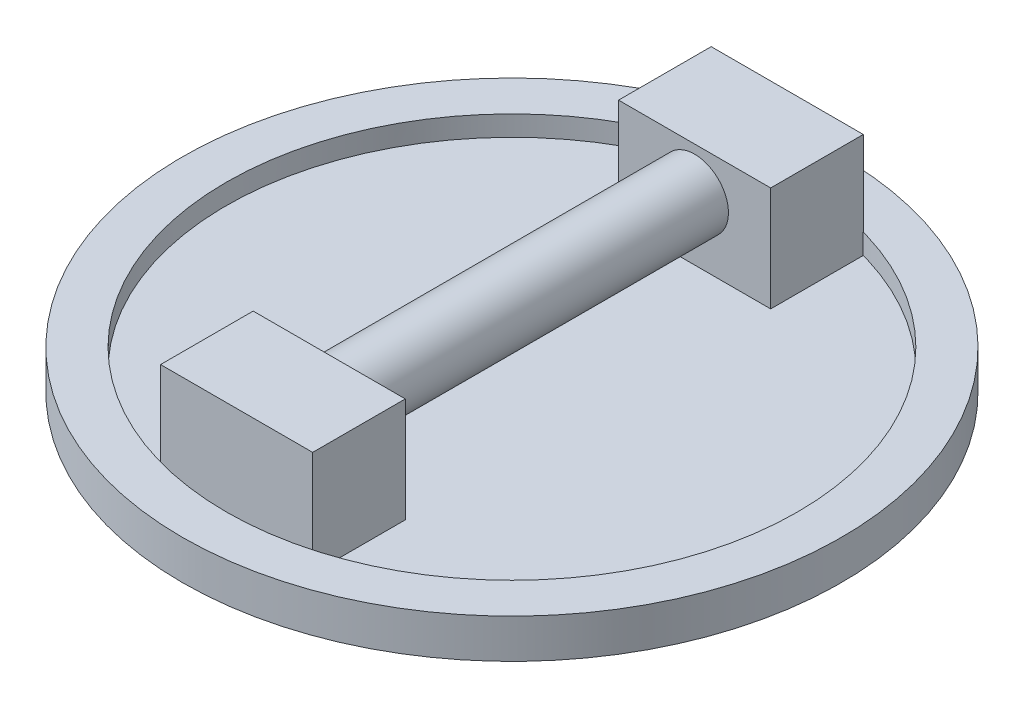
ISO-10303-21;
HEADER;
FILE_DESCRIPTION(('STEP AP214'),'2;1');
FILE_NAME('part.step','',(''),(''),'','','');
FILE_SCHEMA(('AUTOMOTIVE_DESIGN { 1 0 10303 214 1 1 1 1 }'));
ENDSEC;
DATA;
#1=APPLICATION_CONTEXT('core data for automotive mechanical design processes');
#2=APPLICATION_PROTOCOL_DEFINITION('international standard','automotive_design',2000,#1);
#3=PRODUCT_CONTEXT('',#1,'mechanical');
#4=PRODUCT('Part','Part','',(#3));
#5=PRODUCT_RELATED_PRODUCT_CATEGORY('part','',(#4));
#6=PRODUCT_DEFINITION_FORMATION('','',#4);
#7=PRODUCT_DEFINITION_CONTEXT('part definition',#1,'design');
#8=PRODUCT_DEFINITION('design','',#6,#7);
#9=PRODUCT_DEFINITION_SHAPE('','',#8);
#10=(LENGTH_UNIT() NAMED_UNIT(*) SI_UNIT(.MILLI.,.METRE.));
#11=(NAMED_UNIT(*) PLANE_ANGLE_UNIT() SI_UNIT($,.RADIAN.));
#12=(NAMED_UNIT(*) SI_UNIT($,.STERADIAN.) SOLID_ANGLE_UNIT());
#13=UNCERTAINTY_MEASURE_WITH_UNIT(LENGTH_MEASURE(1.E-05),#10,'distance_accuracy_value','');
#14=(GEOMETRIC_REPRESENTATION_CONTEXT(3) GLOBAL_UNCERTAINTY_ASSIGNED_CONTEXT((#13)) GLOBAL_UNIT_ASSIGNED_CONTEXT((#10,
#11,#12)) REPRESENTATION_CONTEXT('',''));
#15=CARTESIAN_POINT('',(0.,0.,0.));
#16=DIRECTION('',(0.,0.,1.));
#17=DIRECTION('',(1.,0.,0.));
#18=AXIS2_PLACEMENT_3D('',#15,#16,#17);
#19=CARTESIAN_POINT('',(-28.575,46.482,103.44070088703));
#20=DIRECTION('',(1.,0.,0.));
#21=DIRECTION('',(0.,0.,-1.));
#22=AXIS2_PLACEMENT_3D('',#19,#20,#21);
#23=PLANE('',#22);
#24=DIRECTION('',(0.,0.,1.));
#25=VECTOR('',#24,1.);
#26=CARTESIAN_POINT('',(-28.575,7.112,103.44070088703));
#27=LINE('',#26,#25);
#28=CARTESIAN_POINT('',(-28.575,7.112,68.64270088703));
#29=VERTEX_POINT('',#28);
#30=CARTESIAN_POINT('',(-28.575,7.112,103.44070088703));
#31=VERTEX_POINT('',#30);
#32=EDGE_CURVE('E145',#29,#31,#27,.T.);
#33=ORIENTED_EDGE('',*,*,#32,.T.);
#34=DIRECTION('',(0.,-1.,0.));
#35=VECTOR('',#34,1.);
#36=CARTESIAN_POINT('',(-28.575,46.482,103.44070088703));
#37=LINE('',#36,#35);
#38=CARTESIAN_POINT('',(-28.575,46.482,103.44070088703));
#39=VERTEX_POINT('',#38);
#40=EDGE_CURVE('E50',#39,#31,#37,.T.);
#41=ORIENTED_EDGE('',*,*,#40,.F.);
#42=DIRECTION('',(0.,0.,1.));
#43=VECTOR('',#42,1.);
#44=CARTESIAN_POINT('',(-28.575,46.482,103.44070088703));
#45=LINE('',#44,#43);
#46=CARTESIAN_POINT('',(-28.575,46.482,68.64270088703));
#47=VERTEX_POINT('',#46);
#48=EDGE_CURVE('E151',#47,#39,#45,.T.);
#49=ORIENTED_EDGE('',*,*,#48,.F.);
#50=DIRECTION('',(0.,-1.,0.));
#51=VECTOR('',#50,1.);
#52=CARTESIAN_POINT('',(-28.575,46.482,68.64270088703));
#53=LINE('',#52,#51);
#54=EDGE_CURVE('E157',#47,#29,#53,.T.);
#55=ORIENTED_EDGE('',*,*,#54,.T.);
#56=EDGE_LOOP('',(#33,#41,#49,#55));
#57=FACE_BOUND('',#56,.T.);
#58=ADVANCED_FACE('F42',(#57),#23,.F.);
#59=CARTESIAN_POINT('',(-28.575,46.482,103.44070088703));
#60=DIRECTION('',(0.,0.,-1.));
#61=DIRECTION('',(-1.,0.,0.));
#62=AXIS2_PLACEMENT_3D('',#59,#60,#61);
#63=PLANE('',#62);
#64=DIRECTION('',(1.,0.,0.));
#65=VECTOR('',#64,1.);
#66=CARTESIAN_POINT('',(-28.575,7.112,103.44070088703));
#67=LINE('',#66,#65);
#68=CARTESIAN_POINT('',(28.575,7.112,103.44070088703));
#69=VERTEX_POINT('',#68);
#70=EDGE_CURVE('E160',#31,#69,#67,.T.);
#71=ORIENTED_EDGE('',*,*,#70,.T.);
#72=DIRECTION('',(0.,-1.,0.));
#73=VECTOR('',#72,1.);
#74=CARTESIAN_POINT('',(28.575,46.482,103.44070088703));
#75=LINE('',#74,#73);
#76=CARTESIAN_POINT('',(28.575,46.482,103.44070088703));
#77=VERTEX_POINT('',#76);
#78=EDGE_CURVE('E167',#77,#69,#75,.T.);
#79=ORIENTED_EDGE('',*,*,#78,.F.);
#80=DIRECTION('',(1.,0.,0.));
#81=VECTOR('',#80,1.);
#82=CARTESIAN_POINT('',(-28.575,46.482,103.44070088703));
#83=LINE('',#82,#81);
#84=EDGE_CURVE('E90',#39,#77,#83,.T.);
#85=ORIENTED_EDGE('',*,*,#84,.F.);
#86=ORIENTED_EDGE('',*,*,#40,.T.);
#87=EDGE_LOOP('',(#71,#79,#85,#86));
#88=FACE_BOUND('',#87,.T.);
#89=ADVANCED_FACE('F169',(#88),#63,.F.);
#90=CARTESIAN_POINT('',(28.575,46.482,103.44070088703));
#91=DIRECTION('',(-1.,0.,0.));
#92=DIRECTION('',(0.,0.,1.));
#93=AXIS2_PLACEMENT_3D('',#90,#91,#92);
#94=PLANE('',#93);
#95=DIRECTION('',(0.,0.,-1.));
#96=VECTOR('',#95,1.);
#97=CARTESIAN_POINT('',(28.575,7.112,103.44070088703));
#98=LINE('',#97,#96);
#99=CARTESIAN_POINT('',(28.575,7.112,68.6427008870299));
#100=VERTEX_POINT('',#99);
#101=EDGE_CURVE('E76',#69,#100,#98,.T.);
#102=ORIENTED_EDGE('',*,*,#101,.T.);
#103=DIRECTION('',(0.,-1.,0.));
#104=VECTOR('',#103,1.);
#105=CARTESIAN_POINT('',(28.575,46.482,68.6427008870299));
#106=LINE('',#105,#104);
#107=CARTESIAN_POINT('',(28.575,46.482,68.6427008870299));
#108=VERTEX_POINT('',#107);
#109=EDGE_CURVE('E165',#108,#100,#106,.T.);
#110=ORIENTED_EDGE('',*,*,#109,.F.);
#111=DIRECTION('',(0.,0.,-1.));
#112=VECTOR('',#111,1.);
#113=CARTESIAN_POINT('',(28.575,46.482,103.44070088703));
#114=LINE('',#113,#112);
#115=EDGE_CURVE('E154',#77,#108,#114,.T.);
#116=ORIENTED_EDGE('',*,*,#115,.F.);
#117=ORIENTED_EDGE('',*,*,#78,.T.);
#118=EDGE_LOOP('',(#102,#110,#116,#117));
#119=FACE_BOUND('',#118,.T.);
#120=ADVANCED_FACE('F192',(#119),#94,.F.);
#121=CARTESIAN_POINT('',(-28.575,46.482,68.64270088703));
#122=DIRECTION('',(0.,0.,1.));
#123=DIRECTION('',(1.,0.,0.));
#124=AXIS2_PLACEMENT_3D('',#121,#122,#123);
#125=PLANE('',#124);
#126=CARTESIAN_POINT('',(0.,30.48,68.6427008870396));
#127=DIRECTION('',(0.,0.,1.));
#128=DIRECTION('',(1.,0.,0.));
#129=AXIS2_PLACEMENT_3D('',#126,#127,#128);
#130=CIRCLE('',#129,12.7);
#131=CARTESIAN_POINT('',(12.7,30.48,68.6427008870396));
#132=VERTEX_POINT('',#131);
#133=EDGE_CURVE('E12',#132,#132,#130,.F.);
#134=ORIENTED_EDGE('',*,*,#133,.F.);
#135=EDGE_LOOP('',(#134));
#136=FACE_BOUND('',#135,.T.);
#137=DIRECTION('',(-1.,0.,0.));
#138=VECTOR('',#137,1.);
#139=CARTESIAN_POINT('',(-28.575,7.112,68.64270088703));
#140=LINE('',#139,#138);
#141=EDGE_CURVE('E82',#100,#29,#140,.T.);
#142=ORIENTED_EDGE('',*,*,#141,.T.);
#143=ORIENTED_EDGE('',*,*,#54,.F.);
#144=DIRECTION('',(-1.,0.,0.));
#145=VECTOR('',#144,1.);
#146=CARTESIAN_POINT('',(-28.575,46.482,68.64270088703));
#147=LINE('',#146,#145);
#148=EDGE_CURVE('E58',#108,#47,#147,.T.);
#149=ORIENTED_EDGE('',*,*,#148,.F.);
#150=ORIENTED_EDGE('',*,*,#109,.T.);
#151=EDGE_LOOP('',(#142,#143,#149,#150));
#152=FACE_BOUND('',#151,.T.);
#153=ADVANCED_FACE('F185',(#136,#152),#125,.F.);
#154=CARTESIAN_POINT('',(0.,46.482,0.));
#155=DIRECTION('',(0.,-1.,0.));
#156=DIRECTION('',(0.,0.,-1.));
#157=AXIS2_PLACEMENT_3D('',#154,#155,#156);
#158=PLANE('',#157);
#159=ORIENTED_EDGE('',*,*,#48,.T.);
#160=ORIENTED_EDGE('',*,*,#84,.T.);
#161=ORIENTED_EDGE('',*,*,#115,.T.);
#162=ORIENTED_EDGE('',*,*,#148,.T.);
#163=EDGE_LOOP('',(#159,#160,#161,#162));
#164=FACE_BOUND('',#163,.T.);
#165=ADVANCED_FACE('F177',(#164),#158,.F.);
#166=CARTESIAN_POINT('',(0.,7.112,0.));
#167=DIRECTION('',(0.,-1.,0.));
#168=DIRECTION('',(0.,0.,-1.));
#169=AXIS2_PLACEMENT_3D('',#166,#167,#168);
#170=PLANE('',#169);
#171=ORIENTED_EDGE('',*,*,#32,.F.);
#172=ORIENTED_EDGE('',*,*,#141,.F.);
#173=ORIENTED_EDGE('',*,*,#101,.F.);
#174=ORIENTED_EDGE('',*,*,#70,.F.);
#175=EDGE_LOOP('',(#171,#172,#173,#174));
#176=FACE_BOUND('',#175,.T.);
#177=ADVANCED_FACE('F174',(#176),#170,.T.);
#178=CARTESIAN_POINT('',(0.,30.48,500000.));
#179=DIRECTION('',(0.,0.,-1.));
#180=DIRECTION('',(-1.,0.,0.));
#181=AXIS2_PLACEMENT_3D('',#178,#179,#180);
#182=CYLINDRICAL_SURFACE('',#181,12.7);
#183=CARTESIAN_POINT('',(0.,30.48,-68.6427008870396));
#184=DIRECTION('',(0.,0.,-1.));
#185=DIRECTION('',(-1.,0.,0.));
#186=AXIS2_PLACEMENT_3D('',#183,#184,#185);
#187=CIRCLE('',#186,12.7);
#188=CARTESIAN_POINT('',(-12.7,30.48,-68.6427008870396));
#189=VERTEX_POINT('',#188);
#190=EDGE_CURVE('E142',#189,#189,#187,.T.);
#191=ORIENTED_EDGE('',*,*,#190,.F.);
#192=EDGE_LOOP('',(#191));
#193=FACE_BOUND('',#192,.T.);
#194=ORIENTED_EDGE('',*,*,#133,.T.);
#195=EDGE_LOOP('',(#194));
#196=FACE_BOUND('',#195,.T.);
#197=ADVANCED_FACE('F176',(#193,#196),#182,.T.);
#198=CARTESIAN_POINT('',(-28.575,46.482,-103.44070088703));
#199=DIRECTION('',(1.,0.,0.));
#200=DIRECTION('',(0.,0.,-1.));
#201=AXIS2_PLACEMENT_3D('',#198,#199,#200);
#202=PLANE('',#201);
#203=DIRECTION('',(0.,0.,1.));
#204=VECTOR('',#203,1.);
#205=CARTESIAN_POINT('',(-28.575,7.112,-103.44070088703));
#206=LINE('',#205,#204);
#207=CARTESIAN_POINT('',(-28.575,7.112,-103.44070088703));
#208=VERTEX_POINT('',#207);
#209=CARTESIAN_POINT('',(-28.575,7.112,-68.6427008870299));
#210=VERTEX_POINT('',#209);
#211=EDGE_CURVE('E141',#208,#210,#206,.T.);
#212=ORIENTED_EDGE('',*,*,#211,.T.);
#213=DIRECTION('',(0.,-1.,0.));
#214=VECTOR('',#213,1.);
#215=CARTESIAN_POINT('',(-28.575,46.482,-68.6427008870299));
#216=LINE('',#215,#214);
#217=CARTESIAN_POINT('',(-28.575,46.482,-68.6427008870299));
#218=VERTEX_POINT('',#217);
#219=EDGE_CURVE('E121',#218,#210,#216,.T.);
#220=ORIENTED_EDGE('',*,*,#219,.F.);
#221=DIRECTION('',(0.,0.,1.));
#222=VECTOR('',#221,1.);
#223=CARTESIAN_POINT('',(-28.575,46.482,-103.44070088703));
#224=LINE('',#223,#222);
#225=CARTESIAN_POINT('',(-28.575,46.482,-103.44070088703));
#226=VERTEX_POINT('',#225);
#227=EDGE_CURVE('E128',#226,#218,#224,.T.);
#228=ORIENTED_EDGE('',*,*,#227,.F.);
#229=DIRECTION('',(0.,-1.,0.));
#230=VECTOR('',#229,1.);
#231=CARTESIAN_POINT('',(-28.575,46.482,-103.44070088703));
#232=LINE('',#231,#230);
#233=EDGE_CURVE('E291',#226,#208,#232,.T.);
#234=ORIENTED_EDGE('',*,*,#233,.T.);
#235=EDGE_LOOP('',(#212,#220,#228,#234));
#236=FACE_BOUND('',#235,.T.);
#237=ADVANCED_FACE('F139',(#236),#202,.F.);
#238=CARTESIAN_POINT('',(-28.575,46.482,-68.6427008870299));
#239=DIRECTION('',(0.,0.,-1.));
#240=DIRECTION('',(-1.,0.,0.));
#241=AXIS2_PLACEMENT_3D('',#238,#239,#240);
#242=PLANE('',#241);
#243=ORIENTED_EDGE('',*,*,#190,.T.);
#244=EDGE_LOOP('',(#243));
#245=FACE_BOUND('',#244,.T.);
#246=DIRECTION('',(1.,0.,0.));
#247=VECTOR('',#246,1.);
#248=CARTESIAN_POINT('',(-28.575,7.112,-68.6427008870299));
#249=LINE('',#248,#247);
#250=CARTESIAN_POINT('',(28.575,7.112,-68.6427008870299));
#251=VERTEX_POINT('',#250);
#252=EDGE_CURVE('E282',#210,#251,#249,.T.);
#253=ORIENTED_EDGE('',*,*,#252,.T.);
#254=DIRECTION('',(0.,-1.,0.));
#255=VECTOR('',#254,1.);
#256=CARTESIAN_POINT('',(28.575,46.482,-68.6427008870299));
#257=LINE('',#256,#255);
#258=CARTESIAN_POINT('',(28.575,46.482,-68.6427008870299));
#259=VERTEX_POINT('',#258);
#260=EDGE_CURVE('E124',#259,#251,#257,.T.);
#261=ORIENTED_EDGE('',*,*,#260,.F.);
#262=DIRECTION('',(1.,0.,0.));
#263=VECTOR('',#262,1.);
#264=CARTESIAN_POINT('',(-28.575,46.482,-68.6427008870299));
#265=LINE('',#264,#263);
#266=EDGE_CURVE('E117',#218,#259,#265,.T.);
#267=ORIENTED_EDGE('',*,*,#266,.F.);
#268=ORIENTED_EDGE('',*,*,#219,.T.);
#269=EDGE_LOOP('',(#253,#261,#267,#268));
#270=FACE_BOUND('',#269,.T.);
#271=ADVANCED_FACE('F119',(#245,#270),#242,.F.);
#272=CARTESIAN_POINT('',(28.575,46.482,-103.44070088703));
#273=DIRECTION('',(-1.,0.,0.));
#274=DIRECTION('',(0.,0.,1.));
#275=AXIS2_PLACEMENT_3D('',#272,#273,#274);
#276=PLANE('',#275);
#277=DIRECTION('',(0.,0.,-1.));
#278=VECTOR('',#277,1.);
#279=CARTESIAN_POINT('',(28.575,7.112,-103.44070088703));
#280=LINE('',#279,#278);
#281=CARTESIAN_POINT('',(28.575,7.112,-103.44070088703));
#282=VERTEX_POINT('',#281);
#283=EDGE_CURVE('E284',#251,#282,#280,.T.);
#284=ORIENTED_EDGE('',*,*,#283,.T.);
#285=DIRECTION('',(0.,-1.,0.));
#286=VECTOR('',#285,1.);
#287=CARTESIAN_POINT('',(28.575,46.482,-103.44070088703));
#288=LINE('',#287,#286);
#289=CARTESIAN_POINT('',(28.575,46.482,-103.44070088703));
#290=VERTEX_POINT('',#289);
#291=EDGE_CURVE('E147',#290,#282,#288,.T.);
#292=ORIENTED_EDGE('',*,*,#291,.F.);
#293=DIRECTION('',(0.,0.,-1.));
#294=VECTOR('',#293,1.);
#295=CARTESIAN_POINT('',(28.575,46.482,-103.44070088703));
#296=LINE('',#295,#294);
#297=EDGE_CURVE('E127',#259,#290,#296,.T.);
#298=ORIENTED_EDGE('',*,*,#297,.F.);
#299=ORIENTED_EDGE('',*,*,#260,.T.);
#300=EDGE_LOOP('',(#284,#292,#298,#299));
#301=FACE_BOUND('',#300,.T.);
#302=ADVANCED_FACE('F233',(#301),#276,.F.);
#303=CARTESIAN_POINT('',(-28.575,46.482,-103.44070088703));
#304=DIRECTION('',(0.,0.,1.));
#305=DIRECTION('',(1.,0.,0.));
#306=AXIS2_PLACEMENT_3D('',#303,#304,#305);
#307=PLANE('',#306);
#308=DIRECTION('',(-1.,0.,0.));
#309=VECTOR('',#308,1.);
#310=CARTESIAN_POINT('',(-28.575,7.112,-103.44070088703));
#311=LINE('',#310,#309);
#312=EDGE_CURVE('E137',#282,#208,#311,.T.);
#313=ORIENTED_EDGE('',*,*,#312,.T.);
#314=ORIENTED_EDGE('',*,*,#233,.F.);
#315=DIRECTION('',(-1.,0.,0.));
#316=VECTOR('',#315,1.);
#317=CARTESIAN_POINT('',(-28.575,46.482,-103.44070088703));
#318=LINE('',#317,#316);
#319=EDGE_CURVE('E133',#290,#226,#318,.T.);
#320=ORIENTED_EDGE('',*,*,#319,.F.);
#321=ORIENTED_EDGE('',*,*,#291,.T.);
#322=EDGE_LOOP('',(#313,#314,#320,#321));
#323=FACE_BOUND('',#322,.T.);
#324=ADVANCED_FACE('F242',(#323),#307,.F.);
#325=CARTESIAN_POINT('',(0.,46.482,0.));
#326=DIRECTION('',(0.,1.,0.));
#327=DIRECTION('',(0.,0.,1.));
#328=AXIS2_PLACEMENT_3D('',#325,#326,#327);
#329=PLANE('',#328);
#330=ORIENTED_EDGE('',*,*,#227,.T.);
#331=ORIENTED_EDGE('',*,*,#266,.T.);
#332=ORIENTED_EDGE('',*,*,#297,.T.);
#333=ORIENTED_EDGE('',*,*,#319,.T.);
#334=EDGE_LOOP('',(#330,#331,#332,#333));
#335=FACE_BOUND('',#334,.T.);
#336=ADVANCED_FACE('F131',(#335),#329,.T.);
#337=CARTESIAN_POINT('',(0.,7.112,0.));
#338=DIRECTION('',(0.,1.,0.));
#339=DIRECTION('',(0.,0.,1.));
#340=AXIS2_PLACEMENT_3D('',#337,#338,#339);
#341=PLANE('',#340);
#342=ORIENTED_EDGE('',*,*,#211,.F.);
#343=ORIENTED_EDGE('',*,*,#312,.F.);
#344=ORIENTED_EDGE('',*,*,#283,.F.);
#345=ORIENTED_EDGE('',*,*,#252,.F.);
#346=EDGE_LOOP('',(#342,#343,#344,#345));
#347=FACE_BOUND('',#346,.T.);
#348=ADVANCED_FACE('F259',(#347),#341,.F.);
#349=CLOSED_SHELL('',(#58,#89,#120,#153,#165,#177,#197,#237,#271,#302,#324,#336,#348));
#350=MANIFOLD_SOLID_BREP('B2',#349);
#351=CARTESIAN_POINT('',(0.,14.732,0.));
#352=DIRECTION('',(0.,-1.,0.));
#353=DIRECTION('',(0.,0.,-1.));
#354=AXIS2_PLACEMENT_3D('',#351,#352,#353);
#355=CYLINDRICAL_SURFACE('',#354,107.315);
#356=CARTESIAN_POINT('',(0.,14.732,0.));
#357=DIRECTION('',(0.,1.,0.));
#358=DIRECTION('',(0.,0.,1.));
#359=AXIS2_PLACEMENT_3D('',#356,#357,#358);
#360=CIRCLE('',#359,107.315);
#361=CARTESIAN_POINT('',(0.,14.732,107.315));
#362=VERTEX_POINT('',#361);
#363=EDGE_CURVE('E321',#362,#362,#360,.T.);
#364=ORIENTED_EDGE('',*,*,#363,.T.);
#365=EDGE_LOOP('',(#364));
#366=FACE_BOUND('',#365,.T.);
#367=CARTESIAN_POINT('',(0.,7.112,0.));
#368=DIRECTION('',(0.,-1.,0.));
#369=DIRECTION('',(0.,0.,-1.));
#370=AXIS2_PLACEMENT_3D('',#367,#368,#369);
#371=CIRCLE('',#370,107.315);
#372=CARTESIAN_POINT('',(0.,7.112,-107.315));
#373=VERTEX_POINT('',#372);
#374=EDGE_CURVE('E325',#373,#373,#371,.T.);
#375=ORIENTED_EDGE('',*,*,#374,.T.);
#376=EDGE_LOOP('',(#375));
#377=FACE_BOUND('',#376,.T.);
#378=ADVANCED_FACE('F310',(#366,#377),#355,.F.);
#379=CARTESIAN_POINT('',(0.,14.732,0.));
#380=DIRECTION('',(0.,1.,0.));
#381=DIRECTION('',(0.,0.,1.));
#382=AXIS2_PLACEMENT_3D('',#379,#380,#381);
#383=PLANE('',#382);
#384=CARTESIAN_POINT('',(0.,14.732,0.));
#385=DIRECTION('',(0.,1.,0.));
#386=DIRECTION('',(0.,0.,1.));
#387=AXIS2_PLACEMENT_3D('',#384,#385,#386);
#388=CIRCLE('',#387,123.825);
#389=CARTESIAN_POINT('',(0.,14.732,123.825));
#390=VERTEX_POINT('',#389);
#391=EDGE_CURVE('E41',#390,#390,#388,.T.);
#392=ORIENTED_EDGE('',*,*,#391,.T.);
#393=EDGE_LOOP('',(#392));
#394=FACE_BOUND('',#393,.T.);
#395=ORIENTED_EDGE('',*,*,#363,.F.);
#396=EDGE_LOOP('',(#395));
#397=FACE_BOUND('',#396,.T.);
#398=ADVANCED_FACE('F340',(#394,#397),#383,.T.);
#399=CARTESIAN_POINT('',(0.,0.,0.));
#400=DIRECTION('',(0.,1.,0.));
#401=DIRECTION('',(0.,0.,1.));
#402=AXIS2_PLACEMENT_3D('',#399,#400,#401);
#403=PLANE('',#402);
#404=CARTESIAN_POINT('',(0.,0.,0.));
#405=DIRECTION('',(0.,1.,0.));
#406=DIRECTION('',(0.,0.,1.));
#407=AXIS2_PLACEMENT_3D('',#404,#405,#406);
#408=CIRCLE('',#407,123.825);
#409=CARTESIAN_POINT('',(0.,0.,123.825));
#410=VERTEX_POINT('',#409);
#411=EDGE_CURVE('E314',#410,#410,#408,.T.);
#412=ORIENTED_EDGE('',*,*,#411,.F.);
#413=EDGE_LOOP('',(#412));
#414=FACE_BOUND('',#413,.T.);
#415=ADVANCED_FACE('F336',(#414),#403,.F.);
#416=CARTESIAN_POINT('',(0.,14.732,0.));
#417=DIRECTION('',(0.,-1.,0.));
#418=DIRECTION('',(0.,0.,-1.));
#419=AXIS2_PLACEMENT_3D('',#416,#417,#418);
#420=CYLINDRICAL_SURFACE('',#419,123.825);
#421=ORIENTED_EDGE('',*,*,#391,.F.);
#422=EDGE_LOOP('',(#421));
#423=FACE_BOUND('',#422,.T.);
#424=ORIENTED_EDGE('',*,*,#411,.T.);
#425=EDGE_LOOP('',(#424));
#426=FACE_BOUND('',#425,.T.);
#427=ADVANCED_FACE('F312',(#423,#426),#420,.T.);
#428=CARTESIAN_POINT('',(0.,7.112,0.));
#429=DIRECTION('',(0.,-1.,0.));
#430=DIRECTION('',(0.,0.,-1.));
#431=AXIS2_PLACEMENT_3D('',#428,#429,#430);
#432=PLANE('',#431);
#433=ORIENTED_EDGE('',*,*,#374,.F.);
#434=EDGE_LOOP('',(#433));
#435=FACE_BOUND('',#434,.T.);
#436=ADVANCED_FACE('F330',(#435),#432,.F.);
#437=CLOSED_SHELL('',(#378,#398,#415,#427,#436));
#438=MANIFOLD_SOLID_BREP('B6',#437);
#439=ADVANCED_BREP_SHAPE_REPRESENTATION('',(#18,#350,#438),#14);
#440=SHAPE_DEFINITION_REPRESENTATION(#9,#439);
ENDSEC;
END-ISO-10303-21;
